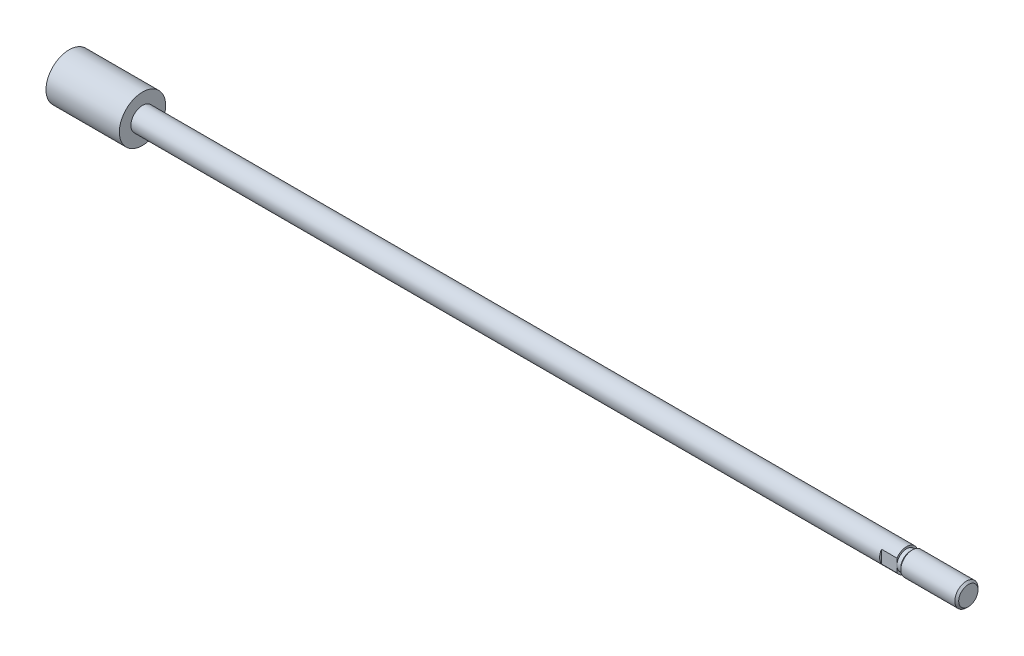
ISO-10303-21;
HEADER;
FILE_DESCRIPTION(('STEP AP214'),'2;1');
FILE_NAME('part.step','',(''),(''),'','','');
FILE_SCHEMA(('AUTOMOTIVE_DESIGN { 1 0 10303 214 1 1 1 1 }'));
ENDSEC;
DATA;
#1=APPLICATION_CONTEXT('core data for automotive mechanical design processes');
#2=APPLICATION_PROTOCOL_DEFINITION('international standard','automotive_design',2000,#1);
#3=PRODUCT_CONTEXT('',#1,'mechanical');
#4=PRODUCT('Part','Part','',(#3));
#5=PRODUCT_RELATED_PRODUCT_CATEGORY('part','',(#4));
#6=PRODUCT_DEFINITION_FORMATION('','',#4);
#7=PRODUCT_DEFINITION_CONTEXT('part definition',#1,'design');
#8=PRODUCT_DEFINITION('design','',#6,#7);
#9=PRODUCT_DEFINITION_SHAPE('','',#8);
#10=(LENGTH_UNIT() NAMED_UNIT(*) SI_UNIT(.MILLI.,.METRE.));
#11=(NAMED_UNIT(*) PLANE_ANGLE_UNIT() SI_UNIT($,.RADIAN.));
#12=(NAMED_UNIT(*) SI_UNIT($,.STERADIAN.) SOLID_ANGLE_UNIT());
#13=UNCERTAINTY_MEASURE_WITH_UNIT(LENGTH_MEASURE(1.E-05),#10,'distance_accuracy_value','');
#14=(GEOMETRIC_REPRESENTATION_CONTEXT(3) GLOBAL_UNCERTAINTY_ASSIGNED_CONTEXT((#13)) GLOBAL_UNIT_ASSIGNED_CONTEXT((#10,
#11,#12)) REPRESENTATION_CONTEXT('',''));
#15=CARTESIAN_POINT('',(0.,0.,0.));
#16=DIRECTION('',(0.,0.,1.));
#17=DIRECTION('',(1.,0.,0.));
#18=AXIS2_PLACEMENT_3D('',#15,#16,#17);
#19=CARTESIAN_POINT('',(-26.3911640481052,0.,0.));
#20=DIRECTION('',(-1.,0.,0.));
#21=DIRECTION('',(0.,0.,1.));
#22=AXIS2_PLACEMENT_3D('',#19,#20,#21);
#23=CYLINDRICAL_SURFACE('',#22,3.);
#24=CARTESIAN_POINT('',(19.,0.,0.));
#25=DIRECTION('',(-1.,0.,0.));
#26=DIRECTION('',(0.,0.,1.));
#27=AXIS2_PLACEMENT_3D('',#24,#25,#26);
#28=CIRCLE('',#27,3.);
#29=CARTESIAN_POINT('',(19.,0.,3.));
#30=VERTEX_POINT('',#29);
#31=EDGE_CURVE('E107',#30,#30,#28,.T.);
#32=ORIENTED_EDGE('',*,*,#31,.F.);
#33=EDGE_LOOP('',(#32));
#34=FACE_BOUND('',#33,.T.);
#35=CARTESIAN_POINT('',(213.,0.,0.));
#36=DIRECTION('',(1.,0.,0.));
#37=DIRECTION('',(0.,0.,-1.));
#38=AXIS2_PLACEMENT_3D('',#35,#36,#37);
#39=CIRCLE('',#38,3.);
#40=CARTESIAN_POINT('',(213.,1.6583123951777,-2.5));
#41=VERTEX_POINT('',#40);
#42=CARTESIAN_POINT('',(213.,-1.6583123951777,-2.5));
#43=VERTEX_POINT('',#42);
#44=EDGE_CURVE('E11',#41,#43,#39,.F.);
#45=ORIENTED_EDGE('',*,*,#44,.T.);
#46=DIRECTION('',(-1.,0.,0.));
#47=VECTOR('',#46,1.);
#48=CARTESIAN_POINT('',(-26.3911640481052,-1.6583123951777,-2.5));
#49=LINE('',#48,#47);
#50=CARTESIAN_POINT('',(217.,-1.6583123951777,-2.5));
#51=VERTEX_POINT('',#50);
#52=EDGE_CURVE('E89',#43,#51,#49,.F.);
#53=ORIENTED_EDGE('',*,*,#52,.T.);
#54=CARTESIAN_POINT('',(217.,0.,0.));
#55=DIRECTION('',(-1.,0.,0.));
#56=DIRECTION('',(0.,0.,1.));
#57=AXIS2_PLACEMENT_3D('',#54,#55,#56);
#58=CIRCLE('',#57,3.);
#59=CARTESIAN_POINT('',(217.,-1.6583123951777,2.5));
#60=VERTEX_POINT('',#59);
#61=EDGE_CURVE('E97',#51,#60,#58,.T.);
#62=ORIENTED_EDGE('',*,*,#61,.T.);
#63=DIRECTION('',(-1.,0.,0.));
#64=VECTOR('',#63,1.);
#65=CARTESIAN_POINT('',(-26.3911640481052,-1.6583123951777,2.5));
#66=LINE('',#65,#64);
#67=CARTESIAN_POINT('',(213.,-1.6583123951777,2.5));
#68=VERTEX_POINT('',#67);
#69=EDGE_CURVE('E123',#68,#60,#66,.F.);
#70=ORIENTED_EDGE('',*,*,#69,.F.);
#71=CARTESIAN_POINT('',(213.,0.,0.));
#72=DIRECTION('',(1.,0.,0.));
#73=DIRECTION('',(0.,0.,-1.));
#74=AXIS2_PLACEMENT_3D('',#71,#72,#73);
#75=CIRCLE('',#74,3.);
#76=CARTESIAN_POINT('',(213.,1.6583123951777,2.5));
#77=VERTEX_POINT('',#76);
#78=EDGE_CURVE('E47',#68,#77,#75,.F.);
#79=ORIENTED_EDGE('',*,*,#78,.T.);
#80=DIRECTION('',(-1.,0.,0.));
#81=VECTOR('',#80,1.);
#82=CARTESIAN_POINT('',(-26.3911640481052,1.6583123951777,2.5));
#83=LINE('',#82,#81);
#84=CARTESIAN_POINT('',(217.,1.6583123951777,2.5));
#85=VERTEX_POINT('',#84);
#86=EDGE_CURVE('E121',#85,#77,#83,.T.);
#87=ORIENTED_EDGE('',*,*,#86,.F.);
#88=CARTESIAN_POINT('',(217.,1.6583123951777,-2.5));
#89=VERTEX_POINT('',#88);
#90=EDGE_CURVE('E103',#85,#89,#58,.T.);
#91=ORIENTED_EDGE('',*,*,#90,.T.);
#92=DIRECTION('',(-1.,0.,0.));
#93=VECTOR('',#92,1.);
#94=CARTESIAN_POINT('',(-26.3911640481052,1.6583123951777,-2.5));
#95=LINE('',#94,#93);
#96=EDGE_CURVE('E54',#89,#41,#95,.T.);
#97=ORIENTED_EDGE('',*,*,#96,.T.);
#98=EDGE_LOOP('',(#45,#53,#62,#70,#79,#87,#91,#97));
#99=FACE_BOUND('',#98,.T.);
#100=ADVANCED_FACE('F39',(#34,#99),#23,.T.);
#101=CARTESIAN_POINT('',(217.,-3.,0.));
#102=DIRECTION('',(1.,0.,0.));
#103=DIRECTION('',(0.,0.,-1.));
#104=AXIS2_PLACEMENT_3D('',#101,#102,#103);
#105=PLANE('',#104);
#106=ORIENTED_EDGE('',*,*,#61,.F.);
#107=DIRECTION('',(0.,1.,0.));
#108=VECTOR('',#107,1.);
#109=CARTESIAN_POINT('',(217.,6.,-2.5));
#110=LINE('',#109,#108);
#111=CARTESIAN_POINT('',(217.,0.,-2.5));
#112=VERTEX_POINT('',#111);
#113=EDGE_CURVE('E86',#51,#112,#110,.T.);
#114=ORIENTED_EDGE('',*,*,#113,.T.);
#115=CARTESIAN_POINT('',(217.,0.,0.));
#116=DIRECTION('',(-1.,0.,0.));
#117=DIRECTION('',(0.,0.,1.));
#118=AXIS2_PLACEMENT_3D('',#115,#116,#117);
#119=CIRCLE('',#118,2.5);
#120=CARTESIAN_POINT('',(217.,0.,2.5));
#121=VERTEX_POINT('',#120);
#122=EDGE_CURVE('E62',#112,#121,#119,.T.);
#123=ORIENTED_EDGE('',*,*,#122,.T.);
#124=DIRECTION('',(0.,1.,0.));
#125=VECTOR('',#124,1.);
#126=CARTESIAN_POINT('',(217.,6.,2.5));
#127=LINE('',#126,#125);
#128=EDGE_CURVE('E102',#60,#121,#127,.T.);
#129=ORIENTED_EDGE('',*,*,#128,.F.);
#130=EDGE_LOOP('',(#106,#114,#123,#129));
#131=FACE_BOUND('',#130,.T.);
#132=ADVANCED_FACE('F101',(#131),#105,.T.);
#133=EDGE_CURVE('E104',#121,#112,#119,.T.);
#134=ORIENTED_EDGE('',*,*,#133,.T.);
#135=EDGE_CURVE('E91',#112,#89,#110,.T.);
#136=ORIENTED_EDGE('',*,*,#135,.T.);
#137=ORIENTED_EDGE('',*,*,#90,.F.);
#138=EDGE_CURVE('E99',#121,#85,#127,.T.);
#139=ORIENTED_EDGE('',*,*,#138,.F.);
#140=EDGE_LOOP('',(#134,#136,#137,#139));
#141=FACE_BOUND('',#140,.T.);
#142=ADVANCED_FACE('F172',(#141),#105,.T.);
#143=CARTESIAN_POINT('',(19.,-3.,0.));
#144=DIRECTION('',(1.,0.,0.));
#145=DIRECTION('',(0.,0.,-1.));
#146=AXIS2_PLACEMENT_3D('',#143,#144,#145);
#147=PLANE('',#146);
#148=ORIENTED_EDGE('',*,*,#31,.T.);
#149=EDGE_LOOP('',(#148));
#150=FACE_BOUND('',#149,.T.);
#151=CARTESIAN_POINT('',(19.,0.,0.));
#152=DIRECTION('',(-1.,0.,0.));
#153=DIRECTION('',(0.,0.,1.));
#154=AXIS2_PLACEMENT_3D('',#151,#152,#153);
#155=CIRCLE('',#154,6.);
#156=CARTESIAN_POINT('',(19.,0.,6.));
#157=VERTEX_POINT('',#156);
#158=EDGE_CURVE('E137',#157,#157,#155,.T.);
#159=ORIENTED_EDGE('',*,*,#158,.F.);
#160=EDGE_LOOP('',(#159));
#161=FACE_BOUND('',#160,.T.);
#162=ADVANCED_FACE('F164',(#150,#161),#147,.T.);
#163=CARTESIAN_POINT('',(-26.3911640481052,0.,0.));
#164=DIRECTION('',(-1.,0.,0.));
#165=DIRECTION('',(0.,0.,1.));
#166=AXIS2_PLACEMENT_3D('',#163,#164,#165);
#167=CYLINDRICAL_SURFACE('',#166,2.5);
#168=CARTESIAN_POINT('',(218.,0.,0.));
#169=DIRECTION('',(-1.,0.,0.));
#170=DIRECTION('',(0.,0.,1.));
#171=AXIS2_PLACEMENT_3D('',#168,#169,#170);
#172=CIRCLE('',#171,2.5);
#173=CARTESIAN_POINT('',(218.,0.,2.5));
#174=VERTEX_POINT('',#173);
#175=EDGE_CURVE('E145',#174,#174,#172,.T.);
#176=ORIENTED_EDGE('',*,*,#175,.T.);
#177=EDGE_LOOP('',(#176));
#178=FACE_BOUND('',#177,.T.);
#179=ORIENTED_EDGE('',*,*,#133,.F.);
#180=ORIENTED_EDGE('',*,*,#122,.F.);
#181=EDGE_LOOP('',(#179,#180));
#182=FACE_BOUND('',#181,.T.);
#183=ADVANCED_FACE('F149',(#178,#182),#167,.T.);
#184=CARTESIAN_POINT('',(218.,0.,0.));
#185=DIRECTION('',(1.,0.,0.));
#186=DIRECTION('',(0.,0.,-1.));
#187=AXIS2_PLACEMENT_3D('',#184,#185,#186);
#188=CONICAL_SURFACE('',#187,2.5,0.785398163397448);
#189=CARTESIAN_POINT('',(218.5,0.,0.));
#190=DIRECTION('',(-1.,0.,0.));
#191=DIRECTION('',(0.,0.,1.));
#192=AXIS2_PLACEMENT_3D('',#189,#190,#191);
#193=CIRCLE('',#192,3.);
#194=CARTESIAN_POINT('',(218.5,0.,3.));
#195=VERTEX_POINT('',#194);
#196=EDGE_CURVE('E143',#195,#195,#193,.T.);
#197=ORIENTED_EDGE('',*,*,#196,.T.);
#198=EDGE_LOOP('',(#197));
#199=FACE_BOUND('',#198,.T.);
#200=ORIENTED_EDGE('',*,*,#175,.F.);
#201=EDGE_LOOP('',(#200));
#202=FACE_BOUND('',#201,.T.);
#203=ADVANCED_FACE('F152',(#199,#202),#188,.T.);
#204=CARTESIAN_POINT('',(-26.3911640481052,0.,0.));
#205=DIRECTION('',(-1.,0.,0.));
#206=DIRECTION('',(0.,0.,1.));
#207=AXIS2_PLACEMENT_3D('',#204,#205,#206);
#208=CYLINDRICAL_SURFACE('',#207,3.);
#209=CARTESIAN_POINT('',(232.5,0.,0.));
#210=DIRECTION('',(1.,0.,0.));
#211=DIRECTION('',(0.,0.,-1.));
#212=AXIS2_PLACEMENT_3D('',#209,#210,#211);
#213=CIRCLE('',#212,3.);
#214=CARTESIAN_POINT('',(232.5,0.,-3.));
#215=VERTEX_POINT('',#214);
#216=EDGE_CURVE('E114',#215,#215,#213,.F.);
#217=ORIENTED_EDGE('',*,*,#216,.T.);
#218=EDGE_LOOP('',(#217));
#219=FACE_BOUND('',#218,.T.);
#220=ORIENTED_EDGE('',*,*,#196,.F.);
#221=EDGE_LOOP('',(#220));
#222=FACE_BOUND('',#221,.T.);
#223=ADVANCED_FACE('F154',(#219,#222),#208,.T.);
#224=CARTESIAN_POINT('',(233.,-3.,0.));
#225=DIRECTION('',(1.,0.,0.));
#226=DIRECTION('',(0.,0.,-1.));
#227=AXIS2_PLACEMENT_3D('',#224,#225,#226);
#228=PLANE('',#227);
#229=CARTESIAN_POINT('',(233.,0.,0.));
#230=DIRECTION('',(1.,0.,0.));
#231=DIRECTION('',(0.,0.,-1.));
#232=AXIS2_PLACEMENT_3D('',#229,#230,#231);
#233=CIRCLE('',#232,2.49999999999989);
#234=CARTESIAN_POINT('',(233.,0.,-2.49999999999989));
#235=VERTEX_POINT('',#234);
#236=EDGE_CURVE('E117',#235,#235,#233,.T.);
#237=ORIENTED_EDGE('',*,*,#236,.T.);
#238=EDGE_LOOP('',(#237));
#239=FACE_BOUND('',#238,.T.);
#240=ADVANCED_FACE('F161',(#239),#228,.T.);
#241=CARTESIAN_POINT('',(0.,-6.,0.));
#242=DIRECTION('',(-1.,0.,0.));
#243=DIRECTION('',(0.,0.,1.));
#244=AXIS2_PLACEMENT_3D('',#241,#242,#243);
#245=PLANE('',#244);
#246=CARTESIAN_POINT('',(0.,0.,0.));
#247=DIRECTION('',(-1.,0.,0.));
#248=DIRECTION('',(0.,0.,1.));
#249=AXIS2_PLACEMENT_3D('',#246,#247,#248);
#250=CIRCLE('',#249,6.);
#251=CARTESIAN_POINT('',(0.,0.,6.));
#252=VERTEX_POINT('',#251);
#253=EDGE_CURVE('E140',#252,#252,#250,.T.);
#254=ORIENTED_EDGE('',*,*,#253,.T.);
#255=EDGE_LOOP('',(#254));
#256=FACE_BOUND('',#255,.T.);
#257=ADVANCED_FACE('F187',(#256),#245,.T.);
#258=CARTESIAN_POINT('',(-26.3911640481052,0.,0.));
#259=DIRECTION('',(-1.,0.,0.));
#260=DIRECTION('',(0.,0.,1.));
#261=AXIS2_PLACEMENT_3D('',#258,#259,#260);
#262=CYLINDRICAL_SURFACE('',#261,6.);
#263=ORIENTED_EDGE('',*,*,#158,.T.);
#264=EDGE_LOOP('',(#263));
#265=FACE_BOUND('',#264,.T.);
#266=ORIENTED_EDGE('',*,*,#253,.F.);
#267=EDGE_LOOP('',(#266));
#268=FACE_BOUND('',#267,.T.);
#269=ADVANCED_FACE('F184',(#265,#268),#262,.T.);
#270=CARTESIAN_POINT('',(232.5,0.,0.));
#271=DIRECTION('',(-1.,0.,0.));
#272=DIRECTION('',(0.,0.,1.));
#273=AXIS2_PLACEMENT_3D('',#270,#271,#272);
#274=CONICAL_SURFACE('',#273,3.,0.785398163397502);
#275=ORIENTED_EDGE('',*,*,#236,.F.);
#276=EDGE_LOOP('',(#275));
#277=FACE_BOUND('',#276,.T.);
#278=ORIENTED_EDGE('',*,*,#216,.F.);
#279=EDGE_LOOP('',(#278));
#280=FACE_BOUND('',#279,.T.);
#281=ADVANCED_FACE('F41',(#277,#280),#274,.T.);
#282=CARTESIAN_POINT('',(213.,6.,2.5));
#283=DIRECTION('',(0.,0.,-1.));
#284=DIRECTION('',(0.,1.,0.));
#285=AXIS2_PLACEMENT_3D('',#282,#283,#284);
#286=PLANE('',#285);
#287=ORIENTED_EDGE('',*,*,#69,.T.);
#288=ORIENTED_EDGE('',*,*,#128,.T.);
#289=ORIENTED_EDGE('',*,*,#138,.T.);
#290=ORIENTED_EDGE('',*,*,#86,.T.);
#291=DIRECTION('',(0.,1.,0.));
#292=VECTOR('',#291,1.);
#293=CARTESIAN_POINT('',(213.,6.,2.5));
#294=LINE('',#293,#292);
#295=EDGE_CURVE('E128',#68,#77,#294,.T.);
#296=ORIENTED_EDGE('',*,*,#295,.F.);
#297=EDGE_LOOP('',(#287,#288,#289,#290,#296));
#298=FACE_BOUND('',#297,.T.);
#299=ADVANCED_FACE('F130',(#298),#286,.F.);
#300=CARTESIAN_POINT('',(213.,-6.,6.));
#301=DIRECTION('',(1.,0.,0.));
#302=DIRECTION('',(0.,0.,-1.));
#303=AXIS2_PLACEMENT_3D('',#300,#301,#302);
#304=PLANE('',#303);
#305=ORIENTED_EDGE('',*,*,#295,.T.);
#306=ORIENTED_EDGE('',*,*,#78,.F.);
#307=EDGE_LOOP('',(#305,#306));
#308=FACE_BOUND('',#307,.T.);
#309=ADVANCED_FACE('F127',(#308),#304,.T.);
#310=CARTESIAN_POINT('',(213.,6.,-2.5));
#311=DIRECTION('',(0.,0.,-1.));
#312=DIRECTION('',(0.,1.,0.));
#313=AXIS2_PLACEMENT_3D('',#310,#311,#312);
#314=PLANE('',#313);
#315=DIRECTION('',(0.,1.,0.));
#316=VECTOR('',#315,1.);
#317=CARTESIAN_POINT('',(213.,6.,-2.5));
#318=LINE('',#317,#316);
#319=EDGE_CURVE('E93',#43,#41,#318,.T.);
#320=ORIENTED_EDGE('',*,*,#319,.T.);
#321=ORIENTED_EDGE('',*,*,#96,.F.);
#322=ORIENTED_EDGE('',*,*,#135,.F.);
#323=ORIENTED_EDGE('',*,*,#113,.F.);
#324=ORIENTED_EDGE('',*,*,#52,.F.);
#325=EDGE_LOOP('',(#320,#321,#322,#323,#324));
#326=FACE_BOUND('',#325,.T.);
#327=ADVANCED_FACE('F88',(#326),#314,.T.);
#328=CARTESIAN_POINT('',(213.,-6.,-6.));
#329=DIRECTION('',(1.,0.,0.));
#330=DIRECTION('',(0.,0.,1.));
#331=AXIS2_PLACEMENT_3D('',#328,#329,#330);
#332=PLANE('',#331);
#333=ORIENTED_EDGE('',*,*,#319,.F.);
#334=ORIENTED_EDGE('',*,*,#44,.F.);
#335=EDGE_LOOP('',(#333,#334));
#336=FACE_BOUND('',#335,.T.);
#337=ADVANCED_FACE('F205',(#336),#332,.T.);
#338=CLOSED_SHELL('',(#100,#132,#142,#162,#183,#203,#223,#240,#257,#269,#281,#299,#309,#327,#337));
#339=MANIFOLD_SOLID_BREP('B2',#338);
#340=ADVANCED_BREP_SHAPE_REPRESENTATION('',(#18,#339),#14);
#341=SHAPE_DEFINITION_REPRESENTATION(#9,#340);
ENDSEC;
END-ISO-10303-21;
